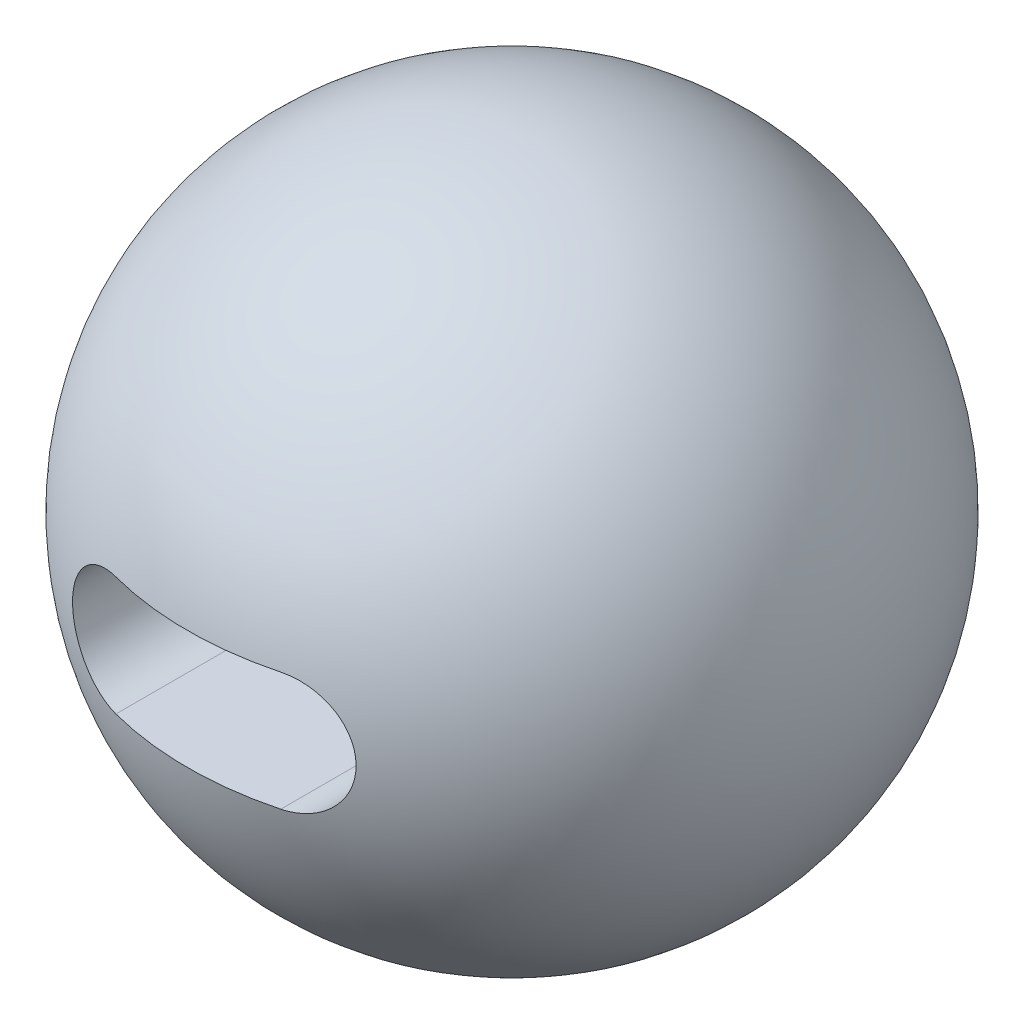
ISO-10303-21;
HEADER;
FILE_DESCRIPTION(('STEP AP214'),'2;1');
FILE_NAME('part.step','',(''),(''),'','','');
FILE_SCHEMA(('AUTOMOTIVE_DESIGN { 1 0 10303 214 1 1 1 1 }'));
ENDSEC;
DATA;
#1=APPLICATION_CONTEXT('core data for automotive mechanical design processes');
#2=APPLICATION_PROTOCOL_DEFINITION('international standard','automotive_design',2000,#1);
#3=PRODUCT_CONTEXT('',#1,'mechanical');
#4=PRODUCT('Part','Part','',(#3));
#5=PRODUCT_RELATED_PRODUCT_CATEGORY('part','',(#4));
#6=PRODUCT_DEFINITION_FORMATION('','',#4);
#7=PRODUCT_DEFINITION_CONTEXT('part definition',#1,'design');
#8=PRODUCT_DEFINITION('design','',#6,#7);
#9=PRODUCT_DEFINITION_SHAPE('','',#8);
#10=(LENGTH_UNIT() NAMED_UNIT(*) SI_UNIT(.MILLI.,.METRE.));
#11=(NAMED_UNIT(*) PLANE_ANGLE_UNIT() SI_UNIT($,.RADIAN.));
#12=(NAMED_UNIT(*) SI_UNIT($,.STERADIAN.) SOLID_ANGLE_UNIT());
#13=UNCERTAINTY_MEASURE_WITH_UNIT(LENGTH_MEASURE(1.E-05),#10,'distance_accuracy_value','');
#14=(GEOMETRIC_REPRESENTATION_CONTEXT(3) GLOBAL_UNCERTAINTY_ASSIGNED_CONTEXT((#13)) GLOBAL_UNIT_ASSIGNED_CONTEXT((#10,
#11,#12)) REPRESENTATION_CONTEXT('',''));
#15=CARTESIAN_POINT('',(0.,0.,0.));
#16=DIRECTION('',(0.,0.,1.));
#17=DIRECTION('',(1.,0.,0.));
#18=AXIS2_PLACEMENT_3D('',#15,#16,#17);
#19=CARTESIAN_POINT('',(0.,0.,0.));
#20=DIRECTION('',(0.,-1.,0.));
#21=DIRECTION('',(-1.,0.,0.));
#22=AXIS2_PLACEMENT_3D('',#19,#20,#21);
#23=SPHERICAL_SURFACE('',#22,500.);
#24=CARTESIAN_POINT('',(0.,-89.9999999999999,0.));
#25=DIRECTION('',(0.,-1.,0.));
#26=DIRECTION('',(0.,0.,-1.));
#27=AXIS2_PLACEMENT_3D('',#24,#25,#26);
#28=CIRCLE('',#27,491.833305094318);
#29=CARTESIAN_POINT('',(125.,-89.9999999999999,475.683718451662));
#30=VERTEX_POINT('',#29);
#31=CARTESIAN_POINT('',(-125.,-89.9999999999999,475.683718451662));
#32=VERTEX_POINT('',#31);
#33=EDGE_CURVE('E110',#30,#32,#28,.T.);
#34=ORIENTED_EDGE('',*,*,#33,.T.);
#35=CARTESIAN_POINT('',(-124.9998,-89.9999999997777,475.683771007589));
#36=CARTESIAN_POINT('',(-126.300196764329,-90.0000169588315,475.342054173253));
#37=CARTESIAN_POINT('',(-127.600501358977,-89.971822447392,474.999991510925));
#38=CARTESIAN_POINT('',(-130.19864421173,-89.8591351999718,474.315776405463));
#39=CARTESIAN_POINT('',(-131.496482471782,-89.7746425084638,473.9736239624));
#40=CARTESIAN_POINT('',(-134.087421100705,-89.5494828886668,473.28982841701));
#41=CARTESIAN_POINT('',(-135.380521438869,-89.4088155969694,472.948185317992));
#42=CARTESIAN_POINT('',(-137.959700346088,-89.071530791727,472.266017446401));
#43=CARTESIAN_POINT('',(-139.245778921659,-88.8749133301161,471.92549267279));
#44=CARTESIAN_POINT('',(-141.808892662611,-88.4259816841502,471.246105822347));
#45=CARTESIAN_POINT('',(-143.08592604846,-88.1736568378467,470.907244076514));
#46=CARTESIAN_POINT('',(-145.628555356472,-87.6136832340733,470.231831351521));
#47=CARTESIAN_POINT('',(-146.894150208636,-87.3060293560635,469.895280589231));
#48=CARTESIAN_POINT('',(-149.411385829537,-86.635907313156,469.225175998921));
#49=CARTESIAN_POINT('',(-150.663028146246,-86.2734452952892,468.891621839254));
#50=CARTESIAN_POINT('',(-153.150372419563,-85.4941823868737,468.22806086787));
#51=CARTESIAN_POINT('',(-154.386072881451,-85.0773764411022,467.898054389263));
#52=CARTESIAN_POINT('',(-156.839982491172,-84.1897796886007,467.242027263606));
#53=CARTESIAN_POINT('',(-158.058179632569,-83.7189536461399,466.91600937336));
#54=CARTESIAN_POINT('',(-160.474136884234,-82.7241945842853,466.268774976236));
#55=CARTESIAN_POINT('',(-161.671895065191,-82.200256583496,465.947558922972));
#56=CARTESIAN_POINT('',(-164.044546925201,-81.1001427189144,465.310610976661));
#57=CARTESIAN_POINT('',(-165.219442377157,-80.523970925382,464.99487865858));
#58=CARTESIAN_POINT('',(-167.544371562446,-79.3201753615146,464.369470254268));
#59=CARTESIAN_POINT('',(-168.6944029391,-78.6925467407534,464.059794742378));
#60=CARTESIAN_POINT('',(-170.966742277017,-77.3871733992575,463.447308945763));
#61=CARTESIAN_POINT('',(-172.089063688178,-76.7094536561788,463.144495336508));
#62=CARTESIAN_POINT('',(-174.304511337109,-75.3046203431547,462.546172482587));
#63=CARTESIAN_POINT('',(-175.397634750793,-74.5775020192133,462.250663944686));
#64=CARTESIAN_POINT('',(-177.552337855046,-73.0751415078594,461.667629898063));
#65=CARTESIAN_POINT('',(-178.613921027935,-72.299904662571,461.380103508271));
#66=CARTESIAN_POINT('',(-180.703570930302,-70.7024937512492,460.813614764031));
#67=CARTESIAN_POINT('',(-181.731634495108,-69.8803152733802,460.534653218355));
#68=CARTESIAN_POINT('',(-184.732430837771,-67.3703697466432,459.719680052391));
#69=CARTESIAN_POINT('',(-186.654198989844,-65.6165616996595,459.196801734261));
#70=CARTESIAN_POINT('',(-190.343565486477,-61.9434940309704,458.191402769126));
#71=CARTESIAN_POINT('',(-192.111164350002,-60.0242349662495,457.708881986271));
#72=CARTESIAN_POINT('',(-195.477845299589,-56.0329251901257,456.788518324527));
#73=CARTESIAN_POINT('',(-197.076920630121,-53.96086835924,456.350677236716));
#74=CARTESIAN_POINT('',(-200.092479117039,-49.6787368989296,455.523930440636));
#75=CARTESIAN_POINT('',(-201.508967636392,-47.4686663260963,455.135023295081));
#76=CARTESIAN_POINT('',(-204.102457730133,-43.002832084589,454.422169771832));
#77=CARTESIAN_POINT('',(-205.28589432189,-40.7510818783589,454.096483159256));
#78=CARTESIAN_POINT('',(-207.460131938214,-36.1497044411806,453.497581866561));
#79=CARTESIAN_POINT('',(-208.450936943197,-33.8000792338775,453.22436610222));
#80=CARTESIAN_POINT('',(-210.230881102229,-29.0206519081034,452.733188630485));
#81=CARTESIAN_POINT('',(-211.02006698761,-26.5908685164082,452.515214119353));
#82=CARTESIAN_POINT('',(-212.389855509802,-21.6688328861263,452.136674040764));
#83=CARTESIAN_POINT('',(-212.970462721223,-19.1765820188779,451.976107214225));
#84=CARTESIAN_POINT('',(-213.902261618226,-14.2306972359327,451.718331104882));
#85=CARTESIAN_POINT('',(-214.260314034798,-11.7784523162653,451.619227332916));
#86=CARTESIAN_POINT('',(-214.773023815815,-6.85119980300602,451.47729634263));
#87=CARTESIAN_POINT('',(-214.927686028323,-4.37619275339443,451.434467782919));
#88=CARTESIAN_POINT('',(-215.032242294544,0.578272526783898,451.405515734962));
#89=CARTESIAN_POINT('',(-214.982152464566,3.05773039166566,451.419387783735));
#90=CARTESIAN_POINT('',(-214.677687330686,8.00309980978396,451.503687623389));
#91=CARTESIAN_POINT('',(-214.423312826565,10.4690114160166,451.574115192852));
#92=CARTESIAN_POINT('',(-213.717870685092,15.3325409372368,451.769345650095));
#93=CARTESIAN_POINT('',(-213.2698057945,17.7306285619477,451.893318412281));
#94=CARTESIAN_POINT('',(-212.18149108625,22.4793505833435,452.19426117268));
#95=CARTESIAN_POINT('',(-211.541243914697,24.8299856329141,452.371230441198));
#96=CARTESIAN_POINT('',(-210.073930117138,29.4676390114814,452.776499481427));
#97=CARTESIAN_POINT('',(-209.246862679954,31.7546570642033,453.004799476018));
#98=CARTESIAN_POINT('',(-207.412701021932,36.2496797585448,453.510626840165));
#99=CARTESIAN_POINT('',(-206.405604645611,38.4576834537469,453.788154799127));
#100=CARTESIAN_POINT('',(-204.208739169169,42.8013660306166,454.392899892158));
#101=CARTESIAN_POINT('',(-203.017277037029,44.9361243839849,454.720577207096));
#102=CARTESIAN_POINT('',(-200.46848406536,49.0964292281686,455.420686250923));
#103=CARTESIAN_POINT('',(-199.11115271547,51.1219753829233,455.793118117516));
#104=CARTESIAN_POINT('',(-196.24099644135,55.0512450423827,456.579571862618));
#105=CARTESIAN_POINT('',(-194.728166120565,56.9549643153916,456.993595184538));
#106=CARTESIAN_POINT('',(-191.55839491709,60.6289345848087,457.859791692973));
#107=CARTESIAN_POINT('',(-189.901451486147,62.3991832201126,458.311965554074));
#108=CARTESIAN_POINT('',(-186.40539325246,65.8450591575715,459.264504175733));
#109=CARTESIAN_POINT('',(-184.562405354891,67.516491022273,459.765882011497));
#110=CARTESIAN_POINT('',(-181.703595667326,69.9016775836028,460.542254522941));
#111=CARTESIAN_POINT('',(-180.734797632632,70.6765113763484,460.805134264039));
#112=CARTESIAN_POINT('',(-178.767373987568,72.1845204362963,461.338517337982));
#113=CARTESIAN_POINT('',(-177.76875099517,72.9176993435752,461.609020001587));
#114=CARTESIAN_POINT('',(-175.742894239141,74.3417292223083,462.157280197168));
#115=CARTESIAN_POINT('',(-174.715645397675,75.0325572493811,462.435041547465));
#116=CARTESIAN_POINT('',(-172.634909485442,76.3704462346006,462.997139953937));
#117=CARTESIAN_POINT('',(-171.581424644723,77.0175108953591,463.281476451081));
#118=CARTESIAN_POINT('',(-169.449872190556,78.2670762229297,463.856243406365));
#119=CARTESIAN_POINT('',(-168.37180286526,78.8695737740064,464.146674288752));
#120=CARTESIAN_POINT('',(-166.193068693446,80.0290810291991,464.733061856164));
#121=CARTESIAN_POINT('',(-165.092405693317,80.5860944319769,465.029018089472));
#122=CARTESIAN_POINT('',(-162.831339723687,81.6726241637085,465.636403746062));
#123=CARTESIAN_POINT('',(-161.670194162344,82.2004957732091,465.948012186148));
#124=CARTESIAN_POINT('',(-159.327728812417,83.205957949971,466.576002792888));
#125=CARTESIAN_POINT('',(-158.146410711801,83.6835527004966,466.892384559871));
#126=CARTESIAN_POINT('',(-155.765297567544,84.5879349166824,467.529439810865));
#127=CARTESIAN_POINT('',(-154.565498384996,85.0147108088008,467.850114254068));
#128=CARTESIAN_POINT('',(-152.149872645188,85.8166876193611,468.495075558381));
#129=CARTESIAN_POINT('',(-150.934047546302,86.1918931957253,468.819362090375));
#130=CARTESIAN_POINT('',(-148.489705126684,86.8898582215957,469.470637677094));
#131=CARTESIAN_POINT('',(-147.261203354545,87.2126752972522,469.797623340866));
#132=CARTESIAN_POINT('',(-144.792379385861,87.8058842291919,470.454049685989));
#133=CARTESIAN_POINT('',(-143.552058257324,88.0762807759819,470.783490144946));
#134=CARTESIAN_POINT('',(-141.062038554494,88.564213737808,471.444163659943));
#135=CARTESIAN_POINT('',(-139.812343506632,88.7817690951682,471.775396029967));
#136=CARTESIAN_POINT('',(-137.305347301511,89.1638148491423,472.439174179546));
#137=CARTESIAN_POINT('',(-136.048047069366,89.3283115727734,472.77171979771));
#138=CARTESIAN_POINT('',(-133.974691885642,89.5551471283291,473.319525503083));
#139=CARTESIAN_POINT('',(-133.160245136181,89.6330278031902,473.53456579271));
#140=CARTESIAN_POINT('',(-131.529729624084,89.7665392018195,473.964781236025));
#141=CARTESIAN_POINT('',(-130.713661222169,89.822174415086,474.179956353715));
#142=CARTESIAN_POINT('',(-129.081698672355,89.9111027666215,474.60996773533));
#143=CARTESIAN_POINT('',(-128.265806553494,89.9444334419283,474.824803958446));
#144=CARTESIAN_POINT('',(-126.633222205506,89.9888861997726,475.254395698364));
#145=CARTESIAN_POINT('',(-125.816529849253,90.0000038515212,475.469151190523));
#146=CARTESIAN_POINT('',(-124.9998,89.9999999997776,475.683771007589));
#147=B_SPLINE_CURVE_WITH_KNOTS('',3,(#35,#36,#37,#38,#39,#40,#41,#42,#43,#44,#45,#46,#47,#48,
#49,#50,#51,#52,#53,#54,#55,#56,#57,#58,#59,#60,#61,#62,#63,#64,#65,#66,#67,#68,#69,#70,#71,#72,
#73,#74,#75,#76,#77,#78,#79,#80,#81,#82,#83,#84,#85,#86,#87,#88,#89,#90,#91,#92,#93,#94,#95,#96,
#97,#98,#99,#100,#101,#102,#103,#104,#105,#106,#107,#108,#109,#110,#111,#112,#113,#114,#115,
#116,#117,#118,#119,#120,#121,#122,#123,#124,#125,#126,#127,#128,#129,#130,#131,#132,#133,#134,
#135,#136,#137,#138,#139,#140,#141,#142,#143,#144,#145,#146),.UNSPECIFIED.,.F.,.F.,(4,2,2,2,2,2,
2,2,2,2,2,2,2,2,2,2,2,2,2,2,2,2,2,2,2,2,2,2,2,2,2,2,2,2,2,2,2,2,2,2,2,2,2,2,2,2,2,2,2,2,2,2,2,2,
2,4),(0.,4.03333858331383,8.0666739805057,12.1000354708441,16.1333932173477,20.1675235865567,
24.2020274950239,28.2360792470902,32.270506525928,36.3075804667172,40.345033397504,
44.3821719842582,48.4196915584831,52.4552112553261,56.491119872158,60.5265812206011,
64.5624224704961,72.5129864984689,80.4635237622131,88.4143796145581,96.3650018799727,
104.049176062156,111.733191446566,119.415424208797,127.097488471701,134.529164320061,
141.960663021789,149.391576791465,156.822461468973,164.142060521501,171.461558797128,
178.781088854795,186.10070655493,193.492036781032,200.88338974997,208.274999320733,
215.666739618887,223.271438284962,227.074837193699,230.877903223692,234.683011751874,
238.487797944027,242.292849882044,246.097592093605,250.035499163888,253.973078322919,
257.911552522319,261.849670757654,265.783427353429,269.716831800204,273.648824125957,
277.580347404791,280.117932452174,282.655005114572,285.187797243716,287.721094533579),.UNSPECIFIED.);
#148=CARTESIAN_POINT('',(-125.,89.9999999999999,475.683718451662));
#149=VERTEX_POINT('',#148);
#150=EDGE_CURVE('E11',#32,#149,#147,.T.);
#151=ORIENTED_EDGE('',*,*,#150,.T.);
#152=CARTESIAN_POINT('',(0.,89.9999999999999,0.));
#153=DIRECTION('',(0.,1.,0.));
#154=DIRECTION('',(0.,0.,1.));
#155=AXIS2_PLACEMENT_3D('',#152,#153,#154);
#156=CIRCLE('',#155,491.833305094318);
#157=CARTESIAN_POINT('',(125.,89.9999999999999,475.683718451662));
#158=VERTEX_POINT('',#157);
#159=EDGE_CURVE('E53',#149,#158,#156,.T.);
#160=ORIENTED_EDGE('',*,*,#159,.T.);
#161=CARTESIAN_POINT('',(124.9998,89.9999999997776,475.683771007589));
#162=CARTESIAN_POINT('',(126.300196764329,90.0000169588314,475.342054173253));
#163=CARTESIAN_POINT('',(127.600501358977,89.9718224473919,474.999991510925));
#164=CARTESIAN_POINT('',(130.19864421173,89.8591351999717,474.315776405463));
#165=CARTESIAN_POINT('',(131.496482471782,89.7746425084636,473.9736239624));
#166=CARTESIAN_POINT('',(134.087421100705,89.5494828886667,473.28982841701));
#167=CARTESIAN_POINT('',(135.380521438869,89.4088155969693,472.948185317992));
#168=CARTESIAN_POINT('',(137.959700346088,89.0715307917269,472.266017446401));
#169=CARTESIAN_POINT('',(139.245778921659,88.874913330116,471.92549267279));
#170=CARTESIAN_POINT('',(141.808892662611,88.4259816841501,471.246105822347));
#171=CARTESIAN_POINT('',(143.08592604846,88.1736568378466,470.907244076514));
#172=CARTESIAN_POINT('',(145.628555356472,87.6136832340732,470.231831351521));
#173=CARTESIAN_POINT('',(146.894150208636,87.3060293560634,469.895280589231));
#174=CARTESIAN_POINT('',(149.411385829537,86.6359073131559,469.225175998921));
#175=CARTESIAN_POINT('',(150.663028146246,86.2734452952891,468.891621839254));
#176=CARTESIAN_POINT('',(153.150372419563,85.4941823868736,468.22806086787));
#177=CARTESIAN_POINT('',(154.386072881451,85.0773764411021,467.898054389263));
#178=CARTESIAN_POINT('',(156.839982491172,84.1897796886005,467.242027263607));
#179=CARTESIAN_POINT('',(158.058179632569,83.7189536461398,466.91600937336));
#180=CARTESIAN_POINT('',(160.474136884234,82.7241945842852,466.268774976236));
#181=CARTESIAN_POINT('',(161.671895065191,82.2002565834959,465.947558922972));
#182=CARTESIAN_POINT('',(164.044546925201,81.1001427189142,465.310610976661));
#183=CARTESIAN_POINT('',(165.219442377157,80.5239709253819,464.99487865858));
#184=CARTESIAN_POINT('',(167.544371562446,79.3201753615145,464.369470254268));
#185=CARTESIAN_POINT('',(168.6944029391,78.6925467407533,464.059794742378));
#186=CARTESIAN_POINT('',(170.966742277017,77.3871733992574,463.447308945763));
#187=CARTESIAN_POINT('',(172.089063688178,76.7094536561787,463.144495336508));
#188=CARTESIAN_POINT('',(174.304511337109,75.3046203431546,462.546172482587));
#189=CARTESIAN_POINT('',(175.397634750793,74.5775020192132,462.250663944686));
#190=CARTESIAN_POINT('',(177.552337855046,73.0751415078593,461.667629898063));
#191=CARTESIAN_POINT('',(178.613921027935,72.2999046625708,461.380103508271));
#192=CARTESIAN_POINT('',(180.703570930302,70.7024937512491,460.813614764031));
#193=CARTESIAN_POINT('',(181.731634495108,69.8803152733801,460.534653218355));
#194=CARTESIAN_POINT('',(184.732430837771,67.3703697466431,459.719680052391));
#195=CARTESIAN_POINT('',(186.654198989844,65.6165616996594,459.196801734261));
#196=CARTESIAN_POINT('',(190.343565486477,61.9434940309702,458.191402769126));
#197=CARTESIAN_POINT('',(192.111164350002,60.0242349662494,457.708881986271));
#198=CARTESIAN_POINT('',(195.477845299589,56.0329251901256,456.788518324527));
#199=CARTESIAN_POINT('',(197.076920630121,53.9608683592399,456.350677236716));
#200=CARTESIAN_POINT('',(200.092479117039,49.6787368989295,455.523930440636));
#201=CARTESIAN_POINT('',(201.508967636392,47.4686663260962,455.135023295081));
#202=CARTESIAN_POINT('',(204.102457730133,43.0028320845888,454.422169771832));
#203=CARTESIAN_POINT('',(205.28589432189,40.7510818783588,454.096483159256));
#204=CARTESIAN_POINT('',(207.460131938214,36.1497044411804,453.497581866561));
#205=CARTESIAN_POINT('',(208.450936943197,33.8000792338774,453.22436610222));
#206=CARTESIAN_POINT('',(210.230881102229,29.0206519081033,452.733188630485));
#207=CARTESIAN_POINT('',(211.02006698761,26.590868516408,452.515214119353));
#208=CARTESIAN_POINT('',(212.389855509802,21.6688328861262,452.136674040764));
#209=CARTESIAN_POINT('',(212.970462721223,19.1765820188778,451.976107214225));
#210=CARTESIAN_POINT('',(213.902261618226,14.2306972359325,451.718331104882));
#211=CARTESIAN_POINT('',(214.260314034798,11.7784523162652,451.619227332916));
#212=CARTESIAN_POINT('',(214.773023815815,6.85119980300588,451.47729634263));
#213=CARTESIAN_POINT('',(214.927686028323,4.37619275339428,451.434467782919));
#214=CARTESIAN_POINT('',(215.032242294544,-0.578272526784056,451.405515734962));
#215=CARTESIAN_POINT('',(214.982152464566,-3.0577303916658,451.419387783735));
#216=CARTESIAN_POINT('',(214.677687330686,-8.0030998097841,451.503687623389));
#217=CARTESIAN_POINT('',(214.423312826565,-10.4690114160167,451.574115192852));
#218=CARTESIAN_POINT('',(213.717870685092,-15.3325409372369,451.769345650095));
#219=CARTESIAN_POINT('',(213.2698057945,-17.7306285619479,451.893318412281));
#220=CARTESIAN_POINT('',(212.18149108625,-22.4793505833437,452.19426117268));
#221=CARTESIAN_POINT('',(211.541243914697,-24.8299856329142,452.371230441198));
#222=CARTESIAN_POINT('',(210.073930117138,-29.4676390114816,452.776499481427));
#223=CARTESIAN_POINT('',(209.246862679954,-31.7546570642035,453.004799476018));
#224=CARTESIAN_POINT('',(207.412701021932,-36.2496797585449,453.510626840165));
#225=CARTESIAN_POINT('',(206.405604645611,-38.4576834537471,453.788154799127));
#226=CARTESIAN_POINT('',(204.208739169169,-42.8013660306167,454.392899892158));
#227=CARTESIAN_POINT('',(203.017277037029,-44.936124383985,454.720577207096));
#228=CARTESIAN_POINT('',(200.468484065359,-49.0964292281688,455.420686250923));
#229=CARTESIAN_POINT('',(199.11115271547,-51.1219753829234,455.793118117516));
#230=CARTESIAN_POINT('',(196.24099644135,-55.0512450423829,456.579571862618));
#231=CARTESIAN_POINT('',(194.728166120565,-56.9549643153918,456.993595184538));
#232=CARTESIAN_POINT('',(191.55839491709,-60.6289345848088,457.859791692973));
#233=CARTESIAN_POINT('',(189.901451486147,-62.3991832201127,458.311965554074));
#234=CARTESIAN_POINT('',(186.40539325246,-65.8450591575717,459.264504175733));
#235=CARTESIAN_POINT('',(184.562405354891,-67.5164910222732,459.765882011497));
#236=CARTESIAN_POINT('',(181.703595667326,-69.9016775836029,460.542254522941));
#237=CARTESIAN_POINT('',(180.734797632632,-70.6765113763485,460.805134264039));
#238=CARTESIAN_POINT('',(178.767373987568,-72.1845204362964,461.338517337982));
#239=CARTESIAN_POINT('',(177.76875099517,-72.9176993435753,461.609020001587));
#240=CARTESIAN_POINT('',(175.742894239141,-74.3417292223085,462.157280197168));
#241=CARTESIAN_POINT('',(174.715645397675,-75.0325572493813,462.435041547465));
#242=CARTESIAN_POINT('',(172.634909485442,-76.3704462346008,462.997139953937));
#243=CARTESIAN_POINT('',(171.581424644723,-77.0175108953593,463.281476451081));
#244=CARTESIAN_POINT('',(169.449872190556,-78.2670762229299,463.856243406365));
#245=CARTESIAN_POINT('',(168.37180286526,-78.8695737740065,464.146674288752));
#246=CARTESIAN_POINT('',(166.193068693446,-80.0290810291992,464.733061856164));
#247=CARTESIAN_POINT('',(165.092405693317,-80.586094431977,465.029018089472));
#248=CARTESIAN_POINT('',(162.831339723687,-81.6726241637086,465.636403746062));
#249=CARTESIAN_POINT('',(161.670194162344,-82.2004957732092,465.948012186148));
#250=CARTESIAN_POINT('',(159.327728812417,-83.2059579499712,466.576002792888));
#251=CARTESIAN_POINT('',(158.146410711801,-83.6835527004967,466.892384559871));
#252=CARTESIAN_POINT('',(155.765297567544,-84.5879349166825,467.529439810865));
#253=CARTESIAN_POINT('',(154.565498384996,-85.0147108088009,467.850114254068));
#254=CARTESIAN_POINT('',(152.149872645188,-85.8166876193612,468.495075558381));
#255=CARTESIAN_POINT('',(150.934047546302,-86.1918931957254,468.819362090375));
#256=CARTESIAN_POINT('',(148.489705126684,-86.8898582215958,469.470637677094));
#257=CARTESIAN_POINT('',(147.261203354545,-87.2126752972523,469.797623340866));
#258=CARTESIAN_POINT('',(144.792379385861,-87.805884229192,470.454049685989));
#259=CARTESIAN_POINT('',(143.552058257324,-88.0762807759821,470.783490144946));
#260=CARTESIAN_POINT('',(141.062038554494,-88.5642137378081,471.444163659943));
#261=CARTESIAN_POINT('',(139.812343506632,-88.7817690951684,471.775396029967));
#262=CARTESIAN_POINT('',(137.305347301511,-89.1638148491424,472.439174179546));
#263=CARTESIAN_POINT('',(136.048047069366,-89.3283115727736,472.77171979771));
#264=CARTESIAN_POINT('',(133.974691885642,-89.5551471283292,473.319525503083));
#265=CARTESIAN_POINT('',(133.160245136181,-89.6330278031903,473.53456579271));
#266=CARTESIAN_POINT('',(131.529729624084,-89.7665392018196,473.964781236025));
#267=CARTESIAN_POINT('',(130.713661222169,-89.8221744150861,474.179956353715));
#268=CARTESIAN_POINT('',(129.081698672355,-89.9111027666216,474.60996773533));
#269=CARTESIAN_POINT('',(128.265806553494,-89.9444334419284,474.824803958446));
#270=CARTESIAN_POINT('',(126.633222205506,-89.9888861997727,475.254395698364));
#271=CARTESIAN_POINT('',(125.816529849253,-90.0000038515213,475.469151190523));
#272=CARTESIAN_POINT('',(124.9998,-89.9999999997777,475.683771007589));
#273=B_SPLINE_CURVE_WITH_KNOTS('',3,(#161,#162,#163,#164,#165,#166,#167,#168,#169,#170,#171,
#172,#173,#174,#175,#176,#177,#178,#179,#180,#181,#182,#183,#184,#185,#186,#187,#188,#189,#190,
#191,#192,#193,#194,#195,#196,#197,#198,#199,#200,#201,#202,#203,#204,#205,#206,#207,#208,#209,
#210,#211,#212,#213,#214,#215,#216,#217,#218,#219,#220,#221,#222,#223,#224,#225,#226,#227,#228,
#229,#230,#231,#232,#233,#234,#235,#236,#237,#238,#239,#240,#241,#242,#243,#244,#245,#246,#247,
#248,#249,#250,#251,#252,#253,#254,#255,#256,#257,#258,#259,#260,#261,#262,#263,#264,#265,#266,
#267,#268,#269,#270,#271,#272),.UNSPECIFIED.,.F.,.F.,(4,2,2,2,2,2,2,2,2,2,2,2,2,2,2,2,2,2,2,2,2,
2,2,2,2,2,2,2,2,2,2,2,2,2,2,2,2,2,2,2,2,2,2,2,2,2,2,2,2,2,2,2,2,2,2,4),(0.,4.03333858331388,
8.06667398050569,12.1000354708441,16.1333932173476,20.1675235865567,24.2020274950239,
28.2360792470902,32.270506525928,36.3075804667172,40.345033397504,44.3821719842582,
48.4196915584831,52.4552112553261,56.491119872158,60.5265812206011,64.5624224704961,
72.5129864984689,80.4635237622131,88.4143796145581,96.3650018799727,104.049176062156,
111.733191446566,119.415424208797,127.097488471701,134.529164320061,141.960663021789,
149.391576791465,156.822461468973,164.142060521501,171.461558797128,178.781088854795,
186.10070655493,193.492036781032,200.88338974997,208.274999320733,215.666739618887,
223.271438284962,227.074837193699,230.877903223692,234.683011751874,238.487797944027,
242.292849882044,246.097592093605,250.035499163888,253.973078322919,257.911552522319,
261.849670757654,265.783427353428,269.716831800204,273.648824125957,277.580347404791,
280.117932452174,282.655005114572,285.187797243716,287.721094533579),.UNSPECIFIED.);
#274=EDGE_CURVE('E115',#158,#30,#273,.T.);
#275=ORIENTED_EDGE('',*,*,#274,.T.);
#276=EDGE_LOOP('',(#34,#151,#160,#275));
#277=FACE_BOUND('',#276,.T.);
#278=ADVANCED_FACE('F41',(#277),#23,.T.);
#279=CARTESIAN_POINT('',(-125.,0.,0.));
#280=DIRECTION('',(0.,0.,1.));
#281=DIRECTION('',(1.,0.,0.));
#282=AXIS2_PLACEMENT_3D('',#279,#280,#281);
#283=CYLINDRICAL_SURFACE('',#282,89.9999999999999);
#284=DIRECTION('',(0.,0.,1.));
#285=VECTOR('',#284,1.);
#286=CARTESIAN_POINT('',(-125.,-89.9999999999999,0.));
#287=LINE('',#286,#285);
#288=CARTESIAN_POINT('',(-125.,-89.9999999999999,0.));
#289=VERTEX_POINT('',#288);
#290=EDGE_CURVE('E60',#289,#32,#287,.T.);
#291=ORIENTED_EDGE('',*,*,#290,.F.);
#292=CARTESIAN_POINT('',(-125.,0.,0.));
#293=DIRECTION('',(0.,0.,1.));
#294=DIRECTION('',(1.,0.,0.));
#295=AXIS2_PLACEMENT_3D('',#292,#293,#294);
#296=CIRCLE('',#295,89.9999999999999);
#297=CARTESIAN_POINT('',(-125.,89.9999999999999,0.));
#298=VERTEX_POINT('',#297);
#299=EDGE_CURVE('E87',#298,#289,#296,.T.);
#300=ORIENTED_EDGE('',*,*,#299,.F.);
#301=DIRECTION('',(0.,0.,1.));
#302=VECTOR('',#301,1.);
#303=CARTESIAN_POINT('',(-125.,89.9999999999999,0.));
#304=LINE('',#303,#302);
#305=EDGE_CURVE('E108',#298,#149,#304,.T.);
#306=ORIENTED_EDGE('',*,*,#305,.T.);
#307=ORIENTED_EDGE('',*,*,#150,.F.);
#308=EDGE_LOOP('',(#291,#300,#306,#307));
#309=FACE_BOUND('',#308,.T.);
#310=ADVANCED_FACE('F85',(#309),#283,.F.);
#311=CARTESIAN_POINT('',(-125.,89.9999999999999,0.));
#312=DIRECTION('',(0.,1.,0.));
#313=DIRECTION('',(0.,0.,1.));
#314=AXIS2_PLACEMENT_3D('',#311,#312,#313);
#315=PLANE('',#314);
#316=ORIENTED_EDGE('',*,*,#305,.F.);
#317=DIRECTION('',(-1.,0.,0.));
#318=VECTOR('',#317,1.);
#319=CARTESIAN_POINT('',(-125.,89.9999999999999,0.));
#320=LINE('',#319,#318);
#321=CARTESIAN_POINT('',(125.,89.9999999999999,0.));
#322=VERTEX_POINT('',#321);
#323=EDGE_CURVE('E91',#322,#298,#320,.T.);
#324=ORIENTED_EDGE('',*,*,#323,.F.);
#325=DIRECTION('',(0.,0.,1.));
#326=VECTOR('',#325,1.);
#327=CARTESIAN_POINT('',(125.,89.9999999999999,0.));
#328=LINE('',#327,#326);
#329=EDGE_CURVE('E111',#322,#158,#328,.T.);
#330=ORIENTED_EDGE('',*,*,#329,.T.);
#331=ORIENTED_EDGE('',*,*,#159,.F.);
#332=EDGE_LOOP('',(#316,#324,#330,#331));
#333=FACE_BOUND('',#332,.T.);
#334=ADVANCED_FACE('F127',(#333),#315,.F.);
#335=CARTESIAN_POINT('',(125.,0.,0.));
#336=DIRECTION('',(0.,0.,1.));
#337=DIRECTION('',(1.,0.,0.));
#338=AXIS2_PLACEMENT_3D('',#335,#336,#337);
#339=CYLINDRICAL_SURFACE('',#338,89.9999999999999);
#340=ORIENTED_EDGE('',*,*,#329,.F.);
#341=CARTESIAN_POINT('',(125.,0.,0.));
#342=DIRECTION('',(0.,0.,1.));
#343=DIRECTION('',(1.,0.,0.));
#344=AXIS2_PLACEMENT_3D('',#341,#342,#343);
#345=CIRCLE('',#344,89.9999999999999);
#346=CARTESIAN_POINT('',(125.,-89.9999999999999,0.));
#347=VERTEX_POINT('',#346);
#348=EDGE_CURVE('E100',#347,#322,#345,.T.);
#349=ORIENTED_EDGE('',*,*,#348,.F.);
#350=DIRECTION('',(0.,0.,1.));
#351=VECTOR('',#350,1.);
#352=CARTESIAN_POINT('',(125.,-89.9999999999999,0.));
#353=LINE('',#352,#351);
#354=EDGE_CURVE('E90',#347,#30,#353,.T.);
#355=ORIENTED_EDGE('',*,*,#354,.T.);
#356=ORIENTED_EDGE('',*,*,#274,.F.);
#357=EDGE_LOOP('',(#340,#349,#355,#356));
#358=FACE_BOUND('',#357,.T.);
#359=ADVANCED_FACE('F122',(#358),#339,.F.);
#360=CARTESIAN_POINT('',(-125.,-89.9999999999999,0.));
#361=DIRECTION('',(0.,-1.,0.));
#362=DIRECTION('',(0.,0.,-1.));
#363=AXIS2_PLACEMENT_3D('',#360,#361,#362);
#364=PLANE('',#363);
#365=ORIENTED_EDGE('',*,*,#354,.F.);
#366=DIRECTION('',(1.,0.,0.));
#367=VECTOR('',#366,1.);
#368=CARTESIAN_POINT('',(-125.,-89.9999999999999,0.));
#369=LINE('',#368,#367);
#370=EDGE_CURVE('E94',#289,#347,#369,.T.);
#371=ORIENTED_EDGE('',*,*,#370,.F.);
#372=ORIENTED_EDGE('',*,*,#290,.T.);
#373=ORIENTED_EDGE('',*,*,#33,.F.);
#374=EDGE_LOOP('',(#365,#371,#372,#373));
#375=FACE_BOUND('',#374,.T.);
#376=ADVANCED_FACE('F95',(#375),#364,.F.);
#377=CARTESIAN_POINT('',(-125.,0.,0.));
#378=DIRECTION('',(0.,0.,1.));
#379=DIRECTION('',(1.,0.,0.));
#380=AXIS2_PLACEMENT_3D('',#377,#378,#379);
#381=PLANE('',#380);
#382=ORIENTED_EDGE('',*,*,#299,.T.);
#383=ORIENTED_EDGE('',*,*,#370,.T.);
#384=ORIENTED_EDGE('',*,*,#348,.T.);
#385=ORIENTED_EDGE('',*,*,#323,.T.);
#386=EDGE_LOOP('',(#382,#383,#384,#385));
#387=FACE_BOUND('',#386,.T.);
#388=ADVANCED_FACE('F102',(#387),#381,.T.);
#389=CLOSED_SHELL('',(#278,#310,#334,#359,#376,#388));
#390=MANIFOLD_SOLID_BREP('B2',#389);
#391=ADVANCED_BREP_SHAPE_REPRESENTATION('',(#18,#390),#14);
#392=SHAPE_DEFINITION_REPRESENTATION(#9,#391);
ENDSEC;
END-ISO-10303-21;
